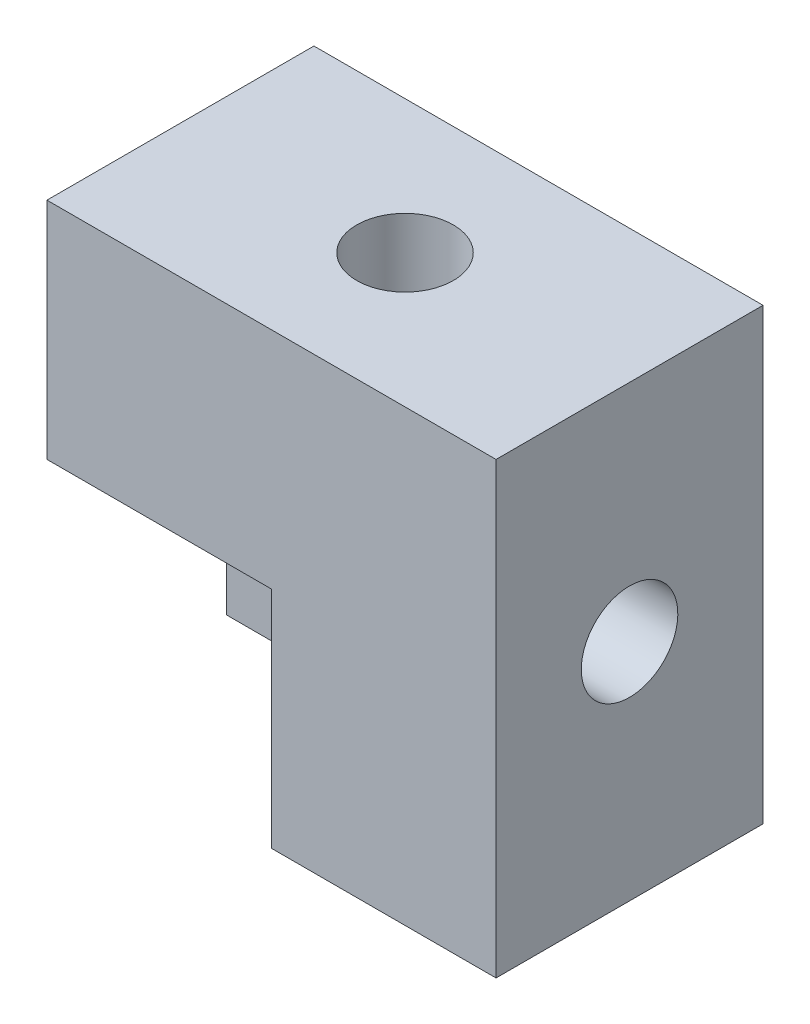
ISO-10303-21;
HEADER;
FILE_DESCRIPTION(('STEP AP214'),'2;1');
FILE_NAME('part.step','',(''),(''),'','','');
FILE_SCHEMA(('AUTOMOTIVE_DESIGN { 1 0 10303 214 1 1 1 1 }'));
ENDSEC;
DATA;
#1=APPLICATION_CONTEXT('core data for automotive mechanical design processes');
#2=APPLICATION_PROTOCOL_DEFINITION('international standard','automotive_design',2000,#1);
#3=PRODUCT_CONTEXT('',#1,'mechanical');
#4=PRODUCT('Part','Part','',(#3));
#5=PRODUCT_RELATED_PRODUCT_CATEGORY('part','',(#4));
#6=PRODUCT_DEFINITION_FORMATION('','',#4);
#7=PRODUCT_DEFINITION_CONTEXT('part definition',#1,'design');
#8=PRODUCT_DEFINITION('design','',#6,#7);
#9=PRODUCT_DEFINITION_SHAPE('','',#8);
#10=(LENGTH_UNIT() NAMED_UNIT(*) SI_UNIT(.MILLI.,.METRE.));
#11=(NAMED_UNIT(*) PLANE_ANGLE_UNIT() SI_UNIT($,.RADIAN.));
#12=(NAMED_UNIT(*) SI_UNIT($,.STERADIAN.) SOLID_ANGLE_UNIT());
#13=UNCERTAINTY_MEASURE_WITH_UNIT(LENGTH_MEASURE(1.E-05),#10,'distance_accuracy_value','');
#14=(GEOMETRIC_REPRESENTATION_CONTEXT(3) GLOBAL_UNCERTAINTY_ASSIGNED_CONTEXT((#13)) GLOBAL_UNIT_ASSIGNED_CONTEXT((#10,
#11,#12)) REPRESENTATION_CONTEXT('',''));
#15=CARTESIAN_POINT('',(0.,0.,0.));
#16=DIRECTION('',(0.,0.,1.));
#17=DIRECTION('',(1.,0.,0.));
#18=AXIS2_PLACEMENT_3D('',#15,#16,#17);
#19=CARTESIAN_POINT('',(20.,0.,11.89));
#20=DIRECTION('',(-1.,0.,0.));
#21=DIRECTION('',(0.,-1.,0.));
#22=AXIS2_PLACEMENT_3D('',#19,#20,#21);
#23=PLANE('',#22);
#24=CARTESIAN_POINT('',(20.,10.,5.945));
#25=DIRECTION('',(1.,0.,0.));
#26=DIRECTION('',(0.,1.,0.));
#27=AXIS2_PLACEMENT_3D('',#24,#25,#26);
#28=CIRCLE('',#27,2.15);
#29=CARTESIAN_POINT('',(20.,12.15,5.945));
#30=VERTEX_POINT('',#29);
#31=EDGE_CURVE('E157',#30,#30,#28,.T.);
#32=ORIENTED_EDGE('',*,*,#31,.F.);
#33=EDGE_LOOP('',(#32));
#34=FACE_BOUND('',#33,.T.);
#35=DIRECTION('',(0.,1.,0.));
#36=VECTOR('',#35,1.);
#37=CARTESIAN_POINT('',(20.,0.,0.));
#38=LINE('',#37,#36);
#39=CARTESIAN_POINT('',(20.,0.,0.));
#40=VERTEX_POINT('',#39);
#41=CARTESIAN_POINT('',(20.,20.,0.));
#42=VERTEX_POINT('',#41);
#43=EDGE_CURVE('E131',#40,#42,#38,.T.);
#44=ORIENTED_EDGE('',*,*,#43,.T.);
#45=DIRECTION('',(0.,0.,-1.));
#46=VECTOR('',#45,1.);
#47=CARTESIAN_POINT('',(20.,20.,11.89));
#48=LINE('',#47,#46);
#49=CARTESIAN_POINT('',(20.,20.,11.89));
#50=VERTEX_POINT('',#49);
#51=EDGE_CURVE('E11',#50,#42,#48,.T.);
#52=ORIENTED_EDGE('',*,*,#51,.F.);
#53=DIRECTION('',(0.,1.,0.));
#54=VECTOR('',#53,1.);
#55=CARTESIAN_POINT('',(20.,0.,11.89));
#56=LINE('',#55,#54);
#57=CARTESIAN_POINT('',(20.,0.,11.89));
#58=VERTEX_POINT('',#57);
#59=EDGE_CURVE('E127',#58,#50,#56,.T.);
#60=ORIENTED_EDGE('',*,*,#59,.F.);
#61=DIRECTION('',(0.,0.,-1.));
#62=VECTOR('',#61,1.);
#63=CARTESIAN_POINT('',(20.,0.,11.89));
#64=LINE('',#63,#62);
#65=EDGE_CURVE('E122',#58,#40,#64,.T.);
#66=ORIENTED_EDGE('',*,*,#65,.T.);
#67=EDGE_LOOP('',(#44,#52,#60,#66));
#68=FACE_BOUND('',#67,.T.);
#69=ADVANCED_FACE('F33',(#34,#68),#23,.F.);
#70=CARTESIAN_POINT('',(20.,20.,11.89));
#71=DIRECTION('',(0.,-1.,0.));
#72=DIRECTION('',(1.,0.,0.));
#73=AXIS2_PLACEMENT_3D('',#70,#71,#72);
#74=PLANE('',#73);
#75=CARTESIAN_POINT('',(9.99999999999999,20.,5.945));
#76=DIRECTION('',(0.,1.,0.));
#77=DIRECTION('',(-1.,0.,0.));
#78=AXIS2_PLACEMENT_3D('',#75,#76,#77);
#79=CIRCLE('',#78,2.15);
#80=CARTESIAN_POINT('',(7.84999999999999,20.,5.945));
#81=VERTEX_POINT('',#80);
#82=EDGE_CURVE('E151',#81,#81,#79,.T.);
#83=ORIENTED_EDGE('',*,*,#82,.F.);
#84=EDGE_LOOP('',(#83));
#85=FACE_BOUND('',#84,.T.);
#86=DIRECTION('',(-1.,0.,0.));
#87=VECTOR('',#86,1.);
#88=CARTESIAN_POINT('',(20.,20.,0.));
#89=LINE('',#88,#87);
#90=CARTESIAN_POINT('',(0.,20.,0.));
#91=VERTEX_POINT('',#90);
#92=EDGE_CURVE('E129',#42,#91,#89,.T.);
#93=ORIENTED_EDGE('',*,*,#92,.T.);
#94=DIRECTION('',(0.,0.,-1.));
#95=VECTOR('',#94,1.);
#96=CARTESIAN_POINT('',(0.,20.,11.89));
#97=LINE('',#96,#95);
#98=CARTESIAN_POINT('',(0.,20.,11.89));
#99=VERTEX_POINT('',#98);
#100=EDGE_CURVE('E40',#99,#91,#97,.T.);
#101=ORIENTED_EDGE('',*,*,#100,.F.);
#102=DIRECTION('',(-1.,0.,0.));
#103=VECTOR('',#102,1.);
#104=CARTESIAN_POINT('',(20.,20.,11.89));
#105=LINE('',#104,#103);
#106=EDGE_CURVE('E80',#50,#99,#105,.T.);
#107=ORIENTED_EDGE('',*,*,#106,.F.);
#108=ORIENTED_EDGE('',*,*,#51,.T.);
#109=EDGE_LOOP('',(#93,#101,#107,#108));
#110=FACE_BOUND('',#109,.T.);
#111=ADVANCED_FACE('F190',(#85,#110),#74,.F.);
#112=CARTESIAN_POINT('',(0.,20.,11.89));
#113=DIRECTION('',(1.,0.,0.));
#114=DIRECTION('',(0.,1.,0.));
#115=AXIS2_PLACEMENT_3D('',#112,#113,#114);
#116=PLANE('',#115);
#117=DIRECTION('',(0.,-1.,0.));
#118=VECTOR('',#117,1.);
#119=CARTESIAN_POINT('',(0.,0.,3.89));
#120=LINE('',#119,#118);
#121=CARTESIAN_POINT('',(0.,10.,3.89));
#122=VERTEX_POINT('',#121);
#123=CARTESIAN_POINT('',(0.,0.,3.89));
#124=VERTEX_POINT('',#123);
#125=EDGE_CURVE('E101',#122,#124,#120,.T.);
#126=ORIENTED_EDGE('',*,*,#125,.F.);
#127=DIRECTION('',(0.,0.,1.));
#128=VECTOR('',#127,1.);
#129=CARTESIAN_POINT('',(0.,10.,3.89));
#130=LINE('',#129,#128);
#131=CARTESIAN_POINT('',(0.,10.,11.89));
#132=VERTEX_POINT('',#131);
#133=EDGE_CURVE('E134',#122,#132,#130,.T.);
#134=ORIENTED_EDGE('',*,*,#133,.T.);
#135=DIRECTION('',(0.,-1.,0.));
#136=VECTOR('',#135,1.);
#137=CARTESIAN_POINT('',(0.,20.,11.89));
#138=LINE('',#137,#136);
#139=EDGE_CURVE('E136',#99,#132,#138,.T.);
#140=ORIENTED_EDGE('',*,*,#139,.F.);
#141=ORIENTED_EDGE('',*,*,#100,.T.);
#142=DIRECTION('',(0.,-1.,0.));
#143=VECTOR('',#142,1.);
#144=CARTESIAN_POINT('',(0.,20.,0.));
#145=LINE('',#144,#143);
#146=CARTESIAN_POINT('',(0.,0.,0.));
#147=VERTEX_POINT('',#146);
#148=EDGE_CURVE('E121',#91,#147,#145,.T.);
#149=ORIENTED_EDGE('',*,*,#148,.T.);
#150=DIRECTION('',(0.,0.,-1.));
#151=VECTOR('',#150,1.);
#152=CARTESIAN_POINT('',(0.,0.,11.89));
#153=LINE('',#152,#151);
#154=EDGE_CURVE('E114',#124,#147,#153,.T.);
#155=ORIENTED_EDGE('',*,*,#154,.F.);
#156=EDGE_LOOP('',(#126,#134,#140,#141,#149,#155));
#157=FACE_BOUND('',#156,.T.);
#158=ADVANCED_FACE('F118',(#157),#116,.F.);
#159=CARTESIAN_POINT('',(0.,0.,11.89));
#160=DIRECTION('',(0.,1.,0.));
#161=DIRECTION('',(0.,0.,1.));
#162=AXIS2_PLACEMENT_3D('',#159,#160,#161);
#163=PLANE('',#162);
#164=DIRECTION('',(1.,0.,0.));
#165=VECTOR('',#164,1.);
#166=CARTESIAN_POINT('',(0.,0.,11.89));
#167=LINE('',#166,#165);
#168=CARTESIAN_POINT('',(10.,0.,11.89));
#169=VERTEX_POINT('',#168);
#170=EDGE_CURVE('E55',#169,#58,#167,.T.);
#171=ORIENTED_EDGE('',*,*,#170,.F.);
#172=DIRECTION('',(0.,0.,1.));
#173=VECTOR('',#172,1.);
#174=CARTESIAN_POINT('',(10.,0.,3.89));
#175=LINE('',#174,#173);
#176=CARTESIAN_POINT('',(10.,0.,3.89));
#177=VERTEX_POINT('',#176);
#178=EDGE_CURVE('E47',#177,#169,#175,.T.);
#179=ORIENTED_EDGE('',*,*,#178,.F.);
#180=DIRECTION('',(1.,0.,0.));
#181=VECTOR('',#180,1.);
#182=CARTESIAN_POINT('',(0.,0.,3.89));
#183=LINE('',#182,#181);
#184=EDGE_CURVE('E105',#124,#177,#183,.T.);
#185=ORIENTED_EDGE('',*,*,#184,.F.);
#186=ORIENTED_EDGE('',*,*,#154,.T.);
#187=DIRECTION('',(1.,0.,0.));
#188=VECTOR('',#187,1.);
#189=CARTESIAN_POINT('',(0.,0.,0.));
#190=LINE('',#189,#188);
#191=EDGE_CURVE('E75',#147,#40,#190,.T.);
#192=ORIENTED_EDGE('',*,*,#191,.T.);
#193=ORIENTED_EDGE('',*,*,#65,.F.);
#194=EDGE_LOOP('',(#171,#179,#185,#186,#192,#193));
#195=FACE_BOUND('',#194,.T.);
#196=ADVANCED_FACE('F113',(#195),#163,.F.);
#197=CARTESIAN_POINT('',(0.,0.,11.89));
#198=DIRECTION('',(0.,0.,1.));
#199=DIRECTION('',(1.,0.,0.));
#200=AXIS2_PLACEMENT_3D('',#197,#198,#199);
#201=PLANE('',#200);
#202=DIRECTION('',(-1.,0.,0.));
#203=VECTOR('',#202,1.);
#204=CARTESIAN_POINT('',(0.,10.,11.89));
#205=LINE('',#204,#203);
#206=CARTESIAN_POINT('',(10.,10.,11.89));
#207=VERTEX_POINT('',#206);
#208=EDGE_CURVE('E111',#207,#132,#205,.T.);
#209=ORIENTED_EDGE('',*,*,#208,.F.);
#210=DIRECTION('',(0.,1.,0.));
#211=VECTOR('',#210,1.);
#212=CARTESIAN_POINT('',(10.,0.,11.89));
#213=LINE('',#212,#211);
#214=EDGE_CURVE('E146',#169,#207,#213,.T.);
#215=ORIENTED_EDGE('',*,*,#214,.F.);
#216=ORIENTED_EDGE('',*,*,#170,.T.);
#217=ORIENTED_EDGE('',*,*,#59,.T.);
#218=ORIENTED_EDGE('',*,*,#106,.T.);
#219=ORIENTED_EDGE('',*,*,#139,.T.);
#220=EDGE_LOOP('',(#209,#215,#216,#217,#218,#219));
#221=FACE_BOUND('',#220,.T.);
#222=ADVANCED_FACE('F182',(#221),#201,.T.);
#223=CARTESIAN_POINT('',(0.,0.,0.));
#224=DIRECTION('',(0.,0.,1.));
#225=DIRECTION('',(1.,0.,0.));
#226=AXIS2_PLACEMENT_3D('',#223,#224,#225);
#227=PLANE('',#226);
#228=CARTESIAN_POINT('',(15.,15.,0.));
#229=DIRECTION('',(0.,0.,-1.));
#230=DIRECTION('',(-1.,0.,0.));
#231=AXIS2_PLACEMENT_3D('',#228,#229,#230);
#232=CIRCLE('',#231,2.15);
#233=CARTESIAN_POINT('',(12.85,15.,0.));
#234=VERTEX_POINT('',#233);
#235=EDGE_CURVE('E163',#234,#234,#232,.T.);
#236=ORIENTED_EDGE('',*,*,#235,.F.);
#237=EDGE_LOOP('',(#236));
#238=FACE_BOUND('',#237,.T.);
#239=ORIENTED_EDGE('',*,*,#43,.F.);
#240=ORIENTED_EDGE('',*,*,#191,.F.);
#241=ORIENTED_EDGE('',*,*,#148,.F.);
#242=ORIENTED_EDGE('',*,*,#92,.F.);
#243=EDGE_LOOP('',(#239,#240,#241,#242));
#244=FACE_BOUND('',#243,.T.);
#245=ADVANCED_FACE('F178',(#238,#244),#227,.F.);
#246=CARTESIAN_POINT('',(0.,10.,3.89));
#247=DIRECTION('',(0.,1.,0.));
#248=DIRECTION('',(0.,0.,1.));
#249=AXIS2_PLACEMENT_3D('',#246,#247,#248);
#250=PLANE('',#249);
#251=ORIENTED_EDGE('',*,*,#208,.T.);
#252=ORIENTED_EDGE('',*,*,#133,.F.);
#253=DIRECTION('',(-1.,0.,0.));
#254=VECTOR('',#253,1.);
#255=CARTESIAN_POINT('',(0.,10.,3.89));
#256=LINE('',#255,#254);
#257=CARTESIAN_POINT('',(10.,10.,3.89));
#258=VERTEX_POINT('',#257);
#259=EDGE_CURVE('E107',#258,#122,#256,.T.);
#260=ORIENTED_EDGE('',*,*,#259,.F.);
#261=DIRECTION('',(0.,0.,1.));
#262=VECTOR('',#261,1.);
#263=CARTESIAN_POINT('',(10.,10.,3.89));
#264=LINE('',#263,#262);
#265=EDGE_CURVE('E142',#258,#207,#264,.T.);
#266=ORIENTED_EDGE('',*,*,#265,.T.);
#267=EDGE_LOOP('',(#251,#252,#260,#266));
#268=FACE_BOUND('',#267,.T.);
#269=ADVANCED_FACE('F181',(#268),#250,.F.);
#270=CARTESIAN_POINT('',(10.,0.,3.89));
#271=DIRECTION('',(1.,0.,0.));
#272=DIRECTION('',(0.,1.,0.));
#273=AXIS2_PLACEMENT_3D('',#270,#271,#272);
#274=PLANE('',#273);
#275=ORIENTED_EDGE('',*,*,#214,.T.);
#276=ORIENTED_EDGE('',*,*,#265,.F.);
#277=DIRECTION('',(0.,1.,0.));
#278=VECTOR('',#277,1.);
#279=CARTESIAN_POINT('',(10.,0.,3.89));
#280=LINE('',#279,#278);
#281=EDGE_CURVE('E116',#177,#258,#280,.T.);
#282=ORIENTED_EDGE('',*,*,#281,.F.);
#283=ORIENTED_EDGE('',*,*,#178,.T.);
#284=EDGE_LOOP('',(#275,#276,#282,#283));
#285=FACE_BOUND('',#284,.T.);
#286=ADVANCED_FACE('F192',(#285),#274,.F.);
#287=CARTESIAN_POINT('',(0.,0.,3.89));
#288=DIRECTION('',(0.,0.,-1.));
#289=DIRECTION('',(-1.,0.,0.));
#290=AXIS2_PLACEMENT_3D('',#287,#288,#289);
#291=PLANE('',#290);
#292=ORIENTED_EDGE('',*,*,#125,.T.);
#293=ORIENTED_EDGE('',*,*,#184,.T.);
#294=ORIENTED_EDGE('',*,*,#281,.T.);
#295=ORIENTED_EDGE('',*,*,#259,.T.);
#296=EDGE_LOOP('',(#292,#293,#294,#295));
#297=FACE_BOUND('',#296,.T.);
#298=ADVANCED_FACE('F103',(#297),#291,.F.);
#299=CARTESIAN_POINT('',(9.99999999999999,13.175,5.945));
#300=DIRECTION('',(0.,1.,0.));
#301=DIRECTION('',(-1.,0.,0.));
#302=AXIS2_PLACEMENT_3D('',#299,#300,#301);
#303=CYLINDRICAL_SURFACE('',#302,2.15);
#304=CARTESIAN_POINT('',(9.99999999999999,13.175,5.945));
#305=DIRECTION('',(0.,1.,0.));
#306=DIRECTION('',(-1.,0.,0.));
#307=AXIS2_PLACEMENT_3D('',#304,#305,#306);
#308=CIRCLE('',#307,2.15);
#309=CARTESIAN_POINT('',(7.84999999999999,13.175,5.945));
#310=VERTEX_POINT('',#309);
#311=EDGE_CURVE('E148',#310,#310,#308,.T.);
#312=ORIENTED_EDGE('',*,*,#311,.F.);
#313=EDGE_LOOP('',(#312));
#314=FACE_BOUND('',#313,.T.);
#315=ORIENTED_EDGE('',*,*,#82,.T.);
#316=EDGE_LOOP('',(#315));
#317=FACE_BOUND('',#316,.T.);
#318=ADVANCED_FACE('F199',(#314,#317),#303,.F.);
#319=CARTESIAN_POINT('',(9.99999999999999,13.175,5.945));
#320=DIRECTION('',(0.,1.,0.));
#321=DIRECTION('',(-1.,0.,0.));
#322=AXIS2_PLACEMENT_3D('',#319,#320,#321);
#323=PLANE('',#322);
#324=ORIENTED_EDGE('',*,*,#311,.T.);
#325=EDGE_LOOP('',(#324));
#326=FACE_BOUND('',#325,.T.);
#327=ADVANCED_FACE('F213',(#326),#323,.T.);
#328=CARTESIAN_POINT('',(13.125,10.,5.945));
#329=DIRECTION('',(1.,0.,0.));
#330=DIRECTION('',(0.,1.,0.));
#331=AXIS2_PLACEMENT_3D('',#328,#329,#330);
#332=CYLINDRICAL_SURFACE('',#331,2.15);
#333=CARTESIAN_POINT('',(13.125,10.,5.945));
#334=DIRECTION('',(1.,0.,0.));
#335=DIRECTION('',(0.,1.,0.));
#336=AXIS2_PLACEMENT_3D('',#333,#334,#335);
#337=CIRCLE('',#336,2.15);
#338=CARTESIAN_POINT('',(13.125,12.15,5.945));
#339=VERTEX_POINT('',#338);
#340=EDGE_CURVE('E154',#339,#339,#337,.T.);
#341=ORIENTED_EDGE('',*,*,#340,.F.);
#342=EDGE_LOOP('',(#341));
#343=FACE_BOUND('',#342,.T.);
#344=ORIENTED_EDGE('',*,*,#31,.T.);
#345=EDGE_LOOP('',(#344));
#346=FACE_BOUND('',#345,.T.);
#347=ADVANCED_FACE('F211',(#343,#346),#332,.F.);
#348=CARTESIAN_POINT('',(13.125,10.,5.945));
#349=DIRECTION('',(1.,0.,0.));
#350=DIRECTION('',(0.,1.,0.));
#351=AXIS2_PLACEMENT_3D('',#348,#349,#350);
#352=PLANE('',#351);
#353=ORIENTED_EDGE('',*,*,#340,.T.);
#354=EDGE_LOOP('',(#353));
#355=FACE_BOUND('',#354,.T.);
#356=ADVANCED_FACE('F174',(#355),#352,.T.);
#357=CARTESIAN_POINT('',(15.,15.,4.825));
#358=DIRECTION('',(0.,0.,-1.));
#359=DIRECTION('',(-1.,0.,0.));
#360=AXIS2_PLACEMENT_3D('',#357,#358,#359);
#361=CYLINDRICAL_SURFACE('',#360,2.15);
#362=CARTESIAN_POINT('',(15.,15.,4.825));
#363=DIRECTION('',(0.,0.,-1.));
#364=DIRECTION('',(-1.,0.,0.));
#365=AXIS2_PLACEMENT_3D('',#362,#363,#364);
#366=CIRCLE('',#365,2.15);
#367=CARTESIAN_POINT('',(12.85,15.,4.825));
#368=VERTEX_POINT('',#367);
#369=EDGE_CURVE('E160',#368,#368,#366,.T.);
#370=ORIENTED_EDGE('',*,*,#369,.F.);
#371=EDGE_LOOP('',(#370));
#372=FACE_BOUND('',#371,.T.);
#373=ORIENTED_EDGE('',*,*,#235,.T.);
#374=EDGE_LOOP('',(#373));
#375=FACE_BOUND('',#374,.T.);
#376=ADVANCED_FACE('F171',(#372,#375),#361,.F.);
#377=CARTESIAN_POINT('',(15.,15.,4.825));
#378=DIRECTION('',(0.,0.,-1.));
#379=DIRECTION('',(-1.,0.,0.));
#380=AXIS2_PLACEMENT_3D('',#377,#378,#379);
#381=PLANE('',#380);
#382=ORIENTED_EDGE('',*,*,#369,.T.);
#383=EDGE_LOOP('',(#382));
#384=FACE_BOUND('',#383,.T.);
#385=ADVANCED_FACE('F169',(#384),#381,.T.);
#386=CLOSED_SHELL('',(#69,#111,#158,#196,#222,#245,#269,#286,#298,#318,#327,#347,#356,#376,#385));
#387=MANIFOLD_SOLID_BREP('B2',#386);
#388=ADVANCED_BREP_SHAPE_REPRESENTATION('',(#18,#387),#14);
#389=SHAPE_DEFINITION_REPRESENTATION(#9,#388);
ENDSEC;
END-ISO-10303-21;
